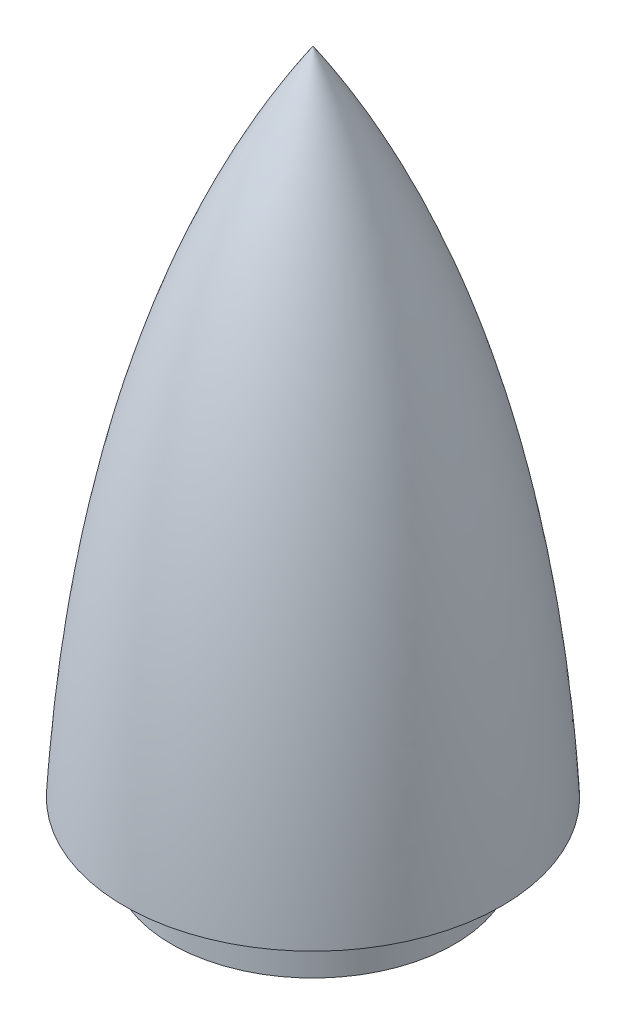
ISO-10303-21;
HEADER;
FILE_DESCRIPTION(('STEP AP214'),'2;1');
FILE_NAME('part.step','',(''),(''),'','','');
FILE_SCHEMA(('AUTOMOTIVE_DESIGN { 1 0 10303 214 1 1 1 1 }'));
ENDSEC;
DATA;
#1=APPLICATION_CONTEXT('core data for automotive mechanical design processes');
#2=APPLICATION_PROTOCOL_DEFINITION('international standard','automotive_design',2000,#1);
#3=PRODUCT_CONTEXT('',#1,'mechanical');
#4=PRODUCT('Part','Part','',(#3));
#5=PRODUCT_RELATED_PRODUCT_CATEGORY('part','',(#4));
#6=PRODUCT_DEFINITION_FORMATION('','',#4);
#7=PRODUCT_DEFINITION_CONTEXT('part definition',#1,'design');
#8=PRODUCT_DEFINITION('design','',#6,#7);
#9=PRODUCT_DEFINITION_SHAPE('','',#8);
#10=(LENGTH_UNIT() NAMED_UNIT(*) SI_UNIT(.MILLI.,.METRE.));
#11=(NAMED_UNIT(*) PLANE_ANGLE_UNIT() SI_UNIT($,.RADIAN.));
#12=(NAMED_UNIT(*) SI_UNIT($,.STERADIAN.) SOLID_ANGLE_UNIT());
#13=UNCERTAINTY_MEASURE_WITH_UNIT(LENGTH_MEASURE(1.E-05),#10,'distance_accuracy_value','');
#14=(GEOMETRIC_REPRESENTATION_CONTEXT(3) GLOBAL_UNCERTAINTY_ASSIGNED_CONTEXT((#13)) GLOBAL_UNIT_ASSIGNED_CONTEXT((#10,
#11,#12)) REPRESENTATION_CONTEXT('',''));
#15=CARTESIAN_POINT('',(0.,0.,0.));
#16=DIRECTION('',(0.,0.,1.));
#17=DIRECTION('',(1.,0.,0.));
#18=AXIS2_PLACEMENT_3D('',#15,#16,#17);
#19=CARTESIAN_POINT('',(20.,5.99220059428314,0.));
#20=CARTESIAN_POINT('',(17.633712319617,48.5258103583508,0.));
#21=CARTESIAN_POINT('',(0.,74.9922005942831,0.));
#22=B_SPLINE_CURVE_WITH_KNOTS('',2,(#19,#20,#21),.UNSPECIFIED.,.F.,.F.,(3,3),(0.,
0.771738446930187),.UNSPECIFIED.);
#23=CARTESIAN_POINT('',(0.,74.9922005942831,0.));
#24=DIRECTION('',(0.,1.,0.));
#25=AXIS1_PLACEMENT('',#23,#24);
#26=SURFACE_OF_REVOLUTION('',#22,#25);
#27=CARTESIAN_POINT('',(0.,74.9922005942831,0.));
#28=VERTEX_POINT('',#27);
#29=VERTEX_LOOP('',#28);
#30=FACE_BOUND('',#29,.T.);
#31=CARTESIAN_POINT('',(0.,5.99220059428314,0.));
#32=DIRECTION('',(0.,1.,0.));
#33=DIRECTION('',(-1.,0.,0.));
#34=AXIS2_PLACEMENT_3D('',#31,#32,#33);
#35=CIRCLE('',#34,20.);
#36=CARTESIAN_POINT('',(-20.,5.99220059428314,0.));
#37=VERTEX_POINT('',#36);
#38=EDGE_CURVE('E57',#37,#37,#35,.T.);
#39=ORIENTED_EDGE('',*,*,#38,.T.);
#40=EDGE_LOOP('',(#39));
#41=FACE_BOUND('',#40,.T.);
#42=ADVANCED_FACE('F41',(#30,#41),#26,.T.);
#43=CARTESIAN_POINT('',(15.,-0.00779940571686327,0.));
#44=DIRECTION('',(0.,1.,0.));
#45=DIRECTION('',(-1.,0.,0.));
#46=AXIS2_PLACEMENT_3D('',#43,#44,#45);
#47=PLANE('',#46);
#48=CARTESIAN_POINT('',(0.,-0.00779940571686566,0.));
#49=DIRECTION('',(0.,1.,0.));
#50=DIRECTION('',(-1.,0.,0.));
#51=AXIS2_PLACEMENT_3D('',#48,#49,#50);
#52=CIRCLE('',#51,15.);
#53=CARTESIAN_POINT('',(-15.,-0.00779940571686749,0.));
#54=VERTEX_POINT('',#53);
#55=EDGE_CURVE('E11',#54,#54,#52,.T.);
#56=ORIENTED_EDGE('',*,*,#55,.F.);
#57=EDGE_LOOP('',(#56));
#58=FACE_BOUND('',#57,.T.);
#59=ADVANCED_FACE('F54',(#58),#47,.F.);
#60=CARTESIAN_POINT('',(0.,74.9922005942831,0.));
#61=DIRECTION('',(0.,1.,0.));
#62=DIRECTION('',(-1.,0.,0.));
#63=AXIS2_PLACEMENT_3D('',#60,#61,#62);
#64=CYLINDRICAL_SURFACE('',#63,15.);
#65=CARTESIAN_POINT('',(0.,5.99220059428314,0.));
#66=DIRECTION('',(0.,1.,0.));
#67=DIRECTION('',(-1.,0.,0.));
#68=AXIS2_PLACEMENT_3D('',#65,#66,#67);
#69=CIRCLE('',#68,15.);
#70=CARTESIAN_POINT('',(-15.,5.99220059428314,0.));
#71=VERTEX_POINT('',#70);
#72=EDGE_CURVE('E49',#71,#71,#69,.T.);
#73=ORIENTED_EDGE('',*,*,#72,.F.);
#74=EDGE_LOOP('',(#73));
#75=FACE_BOUND('',#74,.T.);
#76=ORIENTED_EDGE('',*,*,#55,.T.);
#77=EDGE_LOOP('',(#76));
#78=FACE_BOUND('',#77,.T.);
#79=ADVANCED_FACE('F73',(#75,#78),#64,.T.);
#80=CARTESIAN_POINT('',(20.,5.99220059428314,0.));
#81=DIRECTION('',(0.,1.,0.));
#82=DIRECTION('',(-1.,0.,0.));
#83=AXIS2_PLACEMENT_3D('',#80,#81,#82);
#84=PLANE('',#83);
#85=ORIENTED_EDGE('',*,*,#38,.F.);
#86=EDGE_LOOP('',(#85));
#87=FACE_BOUND('',#86,.T.);
#88=ORIENTED_EDGE('',*,*,#72,.T.);
#89=EDGE_LOOP('',(#88));
#90=FACE_BOUND('',#89,.T.);
#91=ADVANCED_FACE('F71',(#87,#90),#84,.F.);
#92=CLOSED_SHELL('',(#42,#59,#79,#91));
#93=MANIFOLD_SOLID_BREP('B2',#92);
#94=ADVANCED_BREP_SHAPE_REPRESENTATION('',(#18,#93),#14);
#95=SHAPE_DEFINITION_REPRESENTATION(#9,#94);
ENDSEC;
END-ISO-10303-21;
